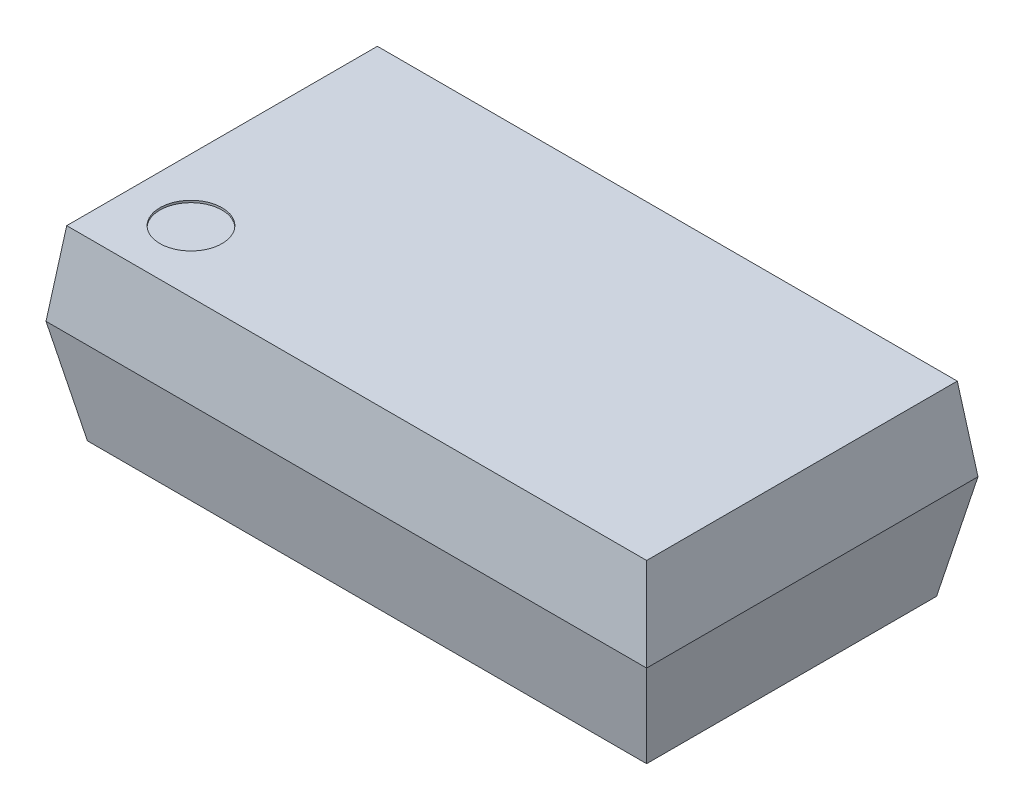
ISO-10303-21;
HEADER;
FILE_DESCRIPTION(('STEP AP214'),'2;1');
FILE_NAME('part.step','',(''),(''),'','','');
FILE_SCHEMA(('AUTOMOTIVE_DESIGN { 1 0 10303 214 1 1 1 1 }'));
ENDSEC;
DATA;
#1=APPLICATION_CONTEXT('core data for automotive mechanical design processes');
#2=APPLICATION_PROTOCOL_DEFINITION('international standard','automotive_design',2000,#1);
#3=PRODUCT_CONTEXT('',#1,'mechanical');
#4=PRODUCT('Part','Part','',(#3));
#5=PRODUCT_RELATED_PRODUCT_CATEGORY('part','',(#4));
#6=PRODUCT_DEFINITION_FORMATION('','',#4);
#7=PRODUCT_DEFINITION_CONTEXT('part definition',#1,'design');
#8=PRODUCT_DEFINITION('design','',#6,#7);
#9=PRODUCT_DEFINITION_SHAPE('','',#8);
#10=(LENGTH_UNIT() NAMED_UNIT(*) SI_UNIT(.MILLI.,.METRE.));
#11=(NAMED_UNIT(*) PLANE_ANGLE_UNIT() SI_UNIT($,.RADIAN.));
#12=(NAMED_UNIT(*) SI_UNIT($,.STERADIAN.) SOLID_ANGLE_UNIT());
#13=UNCERTAINTY_MEASURE_WITH_UNIT(LENGTH_MEASURE(1.E-05),#10,'distance_accuracy_value','');
#14=(GEOMETRIC_REPRESENTATION_CONTEXT(3) GLOBAL_UNCERTAINTY_ASSIGNED_CONTEXT((#13)) GLOBAL_UNIT_ASSIGNED_CONTEXT((#10,
#11,#12)) REPRESENTATION_CONTEXT('',''));
#15=CARTESIAN_POINT('',(0.,0.,0.));
#16=DIRECTION('',(0.,0.,1.));
#17=DIRECTION('',(1.,0.,0.));
#18=AXIS2_PLACEMENT_3D('',#15,#16,#17);
#19=CARTESIAN_POINT('',(0.,0.9,0.));
#20=DIRECTION('',(0.,-1.,0.));
#21=DIRECTION('',(0.,0.,-1.));
#22=AXIS2_PLACEMENT_3D('',#19,#20,#21);
#23=PLANE('',#22);
#24=CARTESIAN_POINT('',(-1.1,0.9,0.45));
#25=DIRECTION('',(0.,1.,0.));
#26=DIRECTION('',(0.,0.,1.));
#27=AXIS2_PLACEMENT_3D('',#24,#25,#26);
#28=CIRCLE('',#27,0.15);
#29=CARTESIAN_POINT('',(-1.1,0.9,0.6));
#30=VERTEX_POINT('',#29);
#31=EDGE_CURVE('E183',#30,#30,#28,.T.);
#32=ORIENTED_EDGE('',*,*,#31,.F.);
#33=EDGE_LOOP('',(#32));
#34=FACE_BOUND('',#33,.T.);
#35=DIRECTION('',(0.,0.,1.));
#36=VECTOR('',#35,1.);
#37=CARTESIAN_POINT('',(1.4,0.9,-0.8));
#38=LINE('',#37,#36);
#39=CARTESIAN_POINT('',(1.4,0.9,-0.75));
#40=VERTEX_POINT('',#39);
#41=CARTESIAN_POINT('',(1.4,0.9,0.749999999999999));
#42=VERTEX_POINT('',#41);
#43=EDGE_CURVE('E113',#40,#42,#38,.T.);
#44=ORIENTED_EDGE('',*,*,#43,.F.);
#45=DIRECTION('',(1.,0.,0.));
#46=VECTOR('',#45,1.);
#47=CARTESIAN_POINT('',(-1.45,0.9,-0.75));
#48=LINE('',#47,#46);
#49=CARTESIAN_POINT('',(-1.4,0.9,-0.75));
#50=VERTEX_POINT('',#49);
#51=EDGE_CURVE('E111',#50,#40,#48,.T.);
#52=ORIENTED_EDGE('',*,*,#51,.F.);
#53=DIRECTION('',(0.,0.,1.));
#54=VECTOR('',#53,1.);
#55=CARTESIAN_POINT('',(-1.4,0.9,-0.8));
#56=LINE('',#55,#54);
#57=CARTESIAN_POINT('',(-1.4,0.9,0.75));
#58=VERTEX_POINT('',#57);
#59=EDGE_CURVE('E171',#50,#58,#56,.T.);
#60=ORIENTED_EDGE('',*,*,#59,.T.);
#61=DIRECTION('',(1.,0.,0.));
#62=VECTOR('',#61,1.);
#63=CARTESIAN_POINT('',(-1.45,0.9,0.75));
#64=LINE('',#63,#62);
#65=EDGE_CURVE('E123',#58,#42,#64,.T.);
#66=ORIENTED_EDGE('',*,*,#65,.T.);
#67=EDGE_LOOP('',(#44,#52,#60,#66));
#68=FACE_BOUND('',#67,.T.);
#69=ADVANCED_FACE('F40',(#34,#68),#23,.F.);
#70=CARTESIAN_POINT('',(-1.45,0.5,0.8));
#71=DIRECTION('',(0.,-0.124034734589209,-0.992277876713668));
#72=DIRECTION('',(0.,0.992277876713668,-0.124034734589209));
#73=AXIS2_PLACEMENT_3D('',#70,#71,#72);
#74=PLANE('',#73);
#75=DIRECTION('',(0.123091490979333,-0.984731927834662,0.123091490979333));
#76=VECTOR('',#75,1.);
#77=CARTESIAN_POINT('',(1.40606060606061,0.851515151515151,0.756060606060606));
#78=LINE('',#77,#76);
#79=CARTESIAN_POINT('',(1.45,0.5,0.8));
#80=VERTEX_POINT('',#79);
#81=EDGE_CURVE('E99',#42,#80,#78,.T.);
#82=ORIENTED_EDGE('',*,*,#81,.F.);
#83=ORIENTED_EDGE('',*,*,#65,.F.);
#84=DIRECTION('',(-0.123091490979333,-0.984731927834662,0.123091490979333));
#85=VECTOR('',#84,1.);
#86=CARTESIAN_POINT('',(-1.45,0.5,0.8));
#87=LINE('',#86,#85);
#88=CARTESIAN_POINT('',(-1.45,0.5,0.8));
#89=VERTEX_POINT('',#88);
#90=EDGE_CURVE('E102',#58,#89,#87,.T.);
#91=ORIENTED_EDGE('',*,*,#90,.T.);
#92=DIRECTION('',(1.,0.,0.));
#93=VECTOR('',#92,1.);
#94=CARTESIAN_POINT('',(-1.45,0.5,0.8));
#95=LINE('',#94,#93);
#96=EDGE_CURVE('E132',#89,#80,#95,.T.);
#97=ORIENTED_EDGE('',*,*,#96,.T.);
#98=EDGE_LOOP('',(#82,#83,#91,#97));
#99=FACE_BOUND('',#98,.T.);
#100=ADVANCED_FACE('F165',(#99),#74,.F.);
#101=CARTESIAN_POINT('',(-1.45,0.5,-0.8));
#102=DIRECTION('',(0.,0.124034734589209,-0.992277876713668));
#103=DIRECTION('',(0.,0.992277876713668,0.124034734589209));
#104=AXIS2_PLACEMENT_3D('',#101,#102,#103);
#105=PLANE('',#104);
#106=ORIENTED_EDGE('',*,*,#51,.T.);
#107=DIRECTION('',(0.123091490979333,-0.984731927834662,-0.123091490979333));
#108=VECTOR('',#107,1.);
#109=CARTESIAN_POINT('',(1.40606060606061,0.851515151515151,-0.756060606060606));
#110=LINE('',#109,#108);
#111=CARTESIAN_POINT('',(1.45,0.5,-0.8));
#112=VERTEX_POINT('',#111);
#113=EDGE_CURVE('E96',#40,#112,#110,.T.);
#114=ORIENTED_EDGE('',*,*,#113,.T.);
#115=DIRECTION('',(1.,0.,0.));
#116=VECTOR('',#115,1.);
#117=CARTESIAN_POINT('',(-1.45,0.5,-0.8));
#118=LINE('',#117,#116);
#119=CARTESIAN_POINT('',(-1.45,0.5,-0.8));
#120=VERTEX_POINT('',#119);
#121=EDGE_CURVE('E109',#120,#112,#118,.T.);
#122=ORIENTED_EDGE('',*,*,#121,.F.);
#123=DIRECTION('',(-0.123091490979333,-0.984731927834662,-0.123091490979333));
#124=VECTOR('',#123,1.);
#125=CARTESIAN_POINT('',(-1.45,0.5,-0.8));
#126=LINE('',#125,#124);
#127=EDGE_CURVE('E63',#50,#120,#126,.T.);
#128=ORIENTED_EDGE('',*,*,#127,.F.);
#129=EDGE_LOOP('',(#106,#114,#122,#128));
#130=FACE_BOUND('',#129,.T.);
#131=ADVANCED_FACE('F107',(#130),#105,.T.);
#132=CARTESIAN_POINT('',(0.,0.,0.));
#133=DIRECTION('',(0.,-1.,0.));
#134=DIRECTION('',(0.,0.,-1.));
#135=AXIS2_PLACEMENT_3D('',#132,#133,#134);
#136=PLANE('',#135);
#137=DIRECTION('',(1.,0.,0.));
#138=VECTOR('',#137,1.);
#139=CARTESIAN_POINT('',(-1.45,0.,-0.7));
#140=LINE('',#139,#138);
#141=CARTESIAN_POINT('',(-1.35,0.,-0.7));
#142=VERTEX_POINT('',#141);
#143=CARTESIAN_POINT('',(1.35,0.,-0.7));
#144=VERTEX_POINT('',#143);
#145=EDGE_CURVE('E122',#142,#144,#140,.T.);
#146=ORIENTED_EDGE('',*,*,#145,.T.);
#147=DIRECTION('',(0.,0.,1.));
#148=VECTOR('',#147,1.);
#149=CARTESIAN_POINT('',(1.35,0.,-0.8));
#150=LINE('',#149,#148);
#151=CARTESIAN_POINT('',(1.35,0.,0.7));
#152=VERTEX_POINT('',#151);
#153=EDGE_CURVE('E56',#144,#152,#150,.T.);
#154=ORIENTED_EDGE('',*,*,#153,.T.);
#155=DIRECTION('',(1.,0.,0.));
#156=VECTOR('',#155,1.);
#157=CARTESIAN_POINT('',(-1.45,0.,0.7));
#158=LINE('',#157,#156);
#159=CARTESIAN_POINT('',(-1.35,0.,0.699999999999999));
#160=VERTEX_POINT('',#159);
#161=EDGE_CURVE('E127',#160,#152,#158,.T.);
#162=ORIENTED_EDGE('',*,*,#161,.F.);
#163=DIRECTION('',(0.,0.,1.));
#164=VECTOR('',#163,1.);
#165=CARTESIAN_POINT('',(-1.35,0.,-0.8));
#166=LINE('',#165,#164);
#167=EDGE_CURVE('E143',#142,#160,#166,.T.);
#168=ORIENTED_EDGE('',*,*,#167,.F.);
#169=EDGE_LOOP('',(#146,#154,#162,#168));
#170=FACE_BOUND('',#169,.T.);
#171=ADVANCED_FACE('F42',(#170),#136,.T.);
#172=CARTESIAN_POINT('',(-1.45,0.5,0.8));
#173=DIRECTION('',(0.,0.196116135138184,-0.98058067569092));
#174=DIRECTION('',(0.,0.98058067569092,0.196116135138184));
#175=AXIS2_PLACEMENT_3D('',#172,#173,#174);
#176=PLANE('',#175);
#177=DIRECTION('',(-0.192450089729875,-0.962250448649376,-0.192450089729875));
#178=VECTOR('',#177,1.);
#179=CARTESIAN_POINT('',(1.34259259259259,-0.0370370370370372,0.692592592592592));
#180=LINE('',#179,#178);
#181=EDGE_CURVE('E149',#80,#152,#180,.T.);
#182=ORIENTED_EDGE('',*,*,#181,.F.);
#183=ORIENTED_EDGE('',*,*,#96,.F.);
#184=DIRECTION('',(0.192450089729875,-0.962250448649376,-0.192450089729875));
#185=VECTOR('',#184,1.);
#186=CARTESIAN_POINT('',(-1.45,0.5,0.8));
#187=LINE('',#186,#185);
#188=EDGE_CURVE('E153',#89,#160,#187,.T.);
#189=ORIENTED_EDGE('',*,*,#188,.T.);
#190=ORIENTED_EDGE('',*,*,#161,.T.);
#191=EDGE_LOOP('',(#182,#183,#189,#190));
#192=FACE_BOUND('',#191,.T.);
#193=ADVANCED_FACE('F162',(#192),#176,.F.);
#194=CARTESIAN_POINT('',(-1.45,0.5,-0.8));
#195=DIRECTION('',(0.,-0.196116135138184,-0.98058067569092));
#196=DIRECTION('',(0.,0.98058067569092,-0.196116135138184));
#197=AXIS2_PLACEMENT_3D('',#194,#195,#196);
#198=PLANE('',#197);
#199=ORIENTED_EDGE('',*,*,#121,.T.);
#200=DIRECTION('',(-0.192450089729875,-0.962250448649376,0.192450089729875));
#201=VECTOR('',#200,1.);
#202=CARTESIAN_POINT('',(1.34259259259259,-0.0370370370370372,-0.692592592592592));
#203=LINE('',#202,#201);
#204=EDGE_CURVE('E11',#112,#144,#203,.T.);
#205=ORIENTED_EDGE('',*,*,#204,.T.);
#206=ORIENTED_EDGE('',*,*,#145,.F.);
#207=DIRECTION('',(0.192450089729875,-0.962250448649376,0.192450089729875));
#208=VECTOR('',#207,1.);
#209=CARTESIAN_POINT('',(-1.45,0.5,-0.8));
#210=LINE('',#209,#208);
#211=EDGE_CURVE('E49',#120,#142,#210,.T.);
#212=ORIENTED_EDGE('',*,*,#211,.F.);
#213=EDGE_LOOP('',(#199,#205,#206,#212));
#214=FACE_BOUND('',#213,.T.);
#215=ADVANCED_FACE('F120',(#214),#198,.T.);
#216=CARTESIAN_POINT('',(-1.45,0.5,-0.8));
#217=DIRECTION('',(0.98058067569092,0.196116135138184,0.));
#218=DIRECTION('',(-0.196116135138184,0.98058067569092,0.));
#219=AXIS2_PLACEMENT_3D('',#216,#217,#218);
#220=PLANE('',#219);
#221=DIRECTION('',(0.,0.,1.));
#222=VECTOR('',#221,1.);
#223=CARTESIAN_POINT('',(-1.45,0.5,-0.8));
#224=LINE('',#223,#222);
#225=EDGE_CURVE('E145',#120,#89,#224,.T.);
#226=ORIENTED_EDGE('',*,*,#225,.F.);
#227=ORIENTED_EDGE('',*,*,#211,.T.);
#228=ORIENTED_EDGE('',*,*,#167,.T.);
#229=ORIENTED_EDGE('',*,*,#188,.F.);
#230=EDGE_LOOP('',(#226,#227,#228,#229));
#231=FACE_BOUND('',#230,.T.);
#232=ADVANCED_FACE('F141',(#231),#220,.F.);
#233=CARTESIAN_POINT('',(1.45,0.5,-0.8));
#234=DIRECTION('',(0.98058067569092,-0.196116135138184,0.));
#235=DIRECTION('',(0.196116135138184,0.98058067569092,0.));
#236=AXIS2_PLACEMENT_3D('',#233,#234,#235);
#237=PLANE('',#236);
#238=ORIENTED_EDGE('',*,*,#181,.T.);
#239=ORIENTED_EDGE('',*,*,#153,.F.);
#240=ORIENTED_EDGE('',*,*,#204,.F.);
#241=DIRECTION('',(0.,0.,1.));
#242=VECTOR('',#241,1.);
#243=CARTESIAN_POINT('',(1.45,0.5,-0.8));
#244=LINE('',#243,#242);
#245=EDGE_CURVE('E93',#112,#80,#244,.T.);
#246=ORIENTED_EDGE('',*,*,#245,.T.);
#247=EDGE_LOOP('',(#238,#239,#240,#246));
#248=FACE_BOUND('',#247,.T.);
#249=ADVANCED_FACE('F115',(#248),#237,.T.);
#250=CARTESIAN_POINT('',(-1.45,0.5,-0.8));
#251=DIRECTION('',(0.992277876713668,-0.124034734589208,0.));
#252=DIRECTION('',(0.124034734589208,0.992277876713668,0.));
#253=AXIS2_PLACEMENT_3D('',#250,#251,#252);
#254=PLANE('',#253);
#255=ORIENTED_EDGE('',*,*,#59,.F.);
#256=ORIENTED_EDGE('',*,*,#127,.T.);
#257=ORIENTED_EDGE('',*,*,#225,.T.);
#258=ORIENTED_EDGE('',*,*,#90,.F.);
#259=EDGE_LOOP('',(#255,#256,#257,#258));
#260=FACE_BOUND('',#259,.T.);
#261=ADVANCED_FACE('F201',(#260),#254,.F.);
#262=CARTESIAN_POINT('',(1.45,0.5,-0.8));
#263=DIRECTION('',(0.992277876713668,0.124034734589208,0.));
#264=DIRECTION('',(-0.124034734589208,0.992277876713668,0.));
#265=AXIS2_PLACEMENT_3D('',#262,#263,#264);
#266=PLANE('',#265);
#267=ORIENTED_EDGE('',*,*,#81,.T.);
#268=ORIENTED_EDGE('',*,*,#245,.F.);
#269=ORIENTED_EDGE('',*,*,#113,.F.);
#270=ORIENTED_EDGE('',*,*,#43,.T.);
#271=EDGE_LOOP('',(#267,#268,#269,#270));
#272=FACE_BOUND('',#271,.T.);
#273=ADVANCED_FACE('F95',(#272),#266,.T.);
#274=CARTESIAN_POINT('',(-1.1,0.89,0.45));
#275=DIRECTION('',(0.,1.,0.));
#276=DIRECTION('',(0.,0.,1.));
#277=AXIS2_PLACEMENT_3D('',#274,#275,#276);
#278=CYLINDRICAL_SURFACE('',#277,0.15);
#279=CARTESIAN_POINT('',(-1.1,0.89,0.45));
#280=DIRECTION('',(0.,1.,0.));
#281=DIRECTION('',(0.,0.,1.));
#282=AXIS2_PLACEMENT_3D('',#279,#280,#281);
#283=CIRCLE('',#282,0.15);
#284=CARTESIAN_POINT('',(-1.1,0.89,0.6));
#285=VERTEX_POINT('',#284);
#286=EDGE_CURVE('E182',#285,#285,#283,.T.);
#287=ORIENTED_EDGE('',*,*,#286,.F.);
#288=EDGE_LOOP('',(#287));
#289=FACE_BOUND('',#288,.T.);
#290=ORIENTED_EDGE('',*,*,#31,.T.);
#291=EDGE_LOOP('',(#290));
#292=FACE_BOUND('',#291,.T.);
#293=ADVANCED_FACE('F193',(#289,#292),#278,.F.);
#294=CARTESIAN_POINT('',(-1.1,0.89,0.45));
#295=DIRECTION('',(0.,1.,0.));
#296=DIRECTION('',(0.,0.,1.));
#297=AXIS2_PLACEMENT_3D('',#294,#295,#296);
#298=PLANE('',#297);
#299=ORIENTED_EDGE('',*,*,#286,.T.);
#300=EDGE_LOOP('',(#299));
#301=FACE_BOUND('',#300,.T.);
#302=ADVANCED_FACE('F191',(#301),#298,.T.);
#303=CLOSED_SHELL('',(#69,#100,#131,#171,#193,#215,#232,#249,#261,#273,#293,#302));
#304=MANIFOLD_SOLID_BREP('B2',#303);
#305=ADVANCED_BREP_SHAPE_REPRESENTATION('',(#18,#304),#14);
#306=SHAPE_DEFINITION_REPRESENTATION(#9,#305);
ENDSEC;
END-ISO-10303-21;
